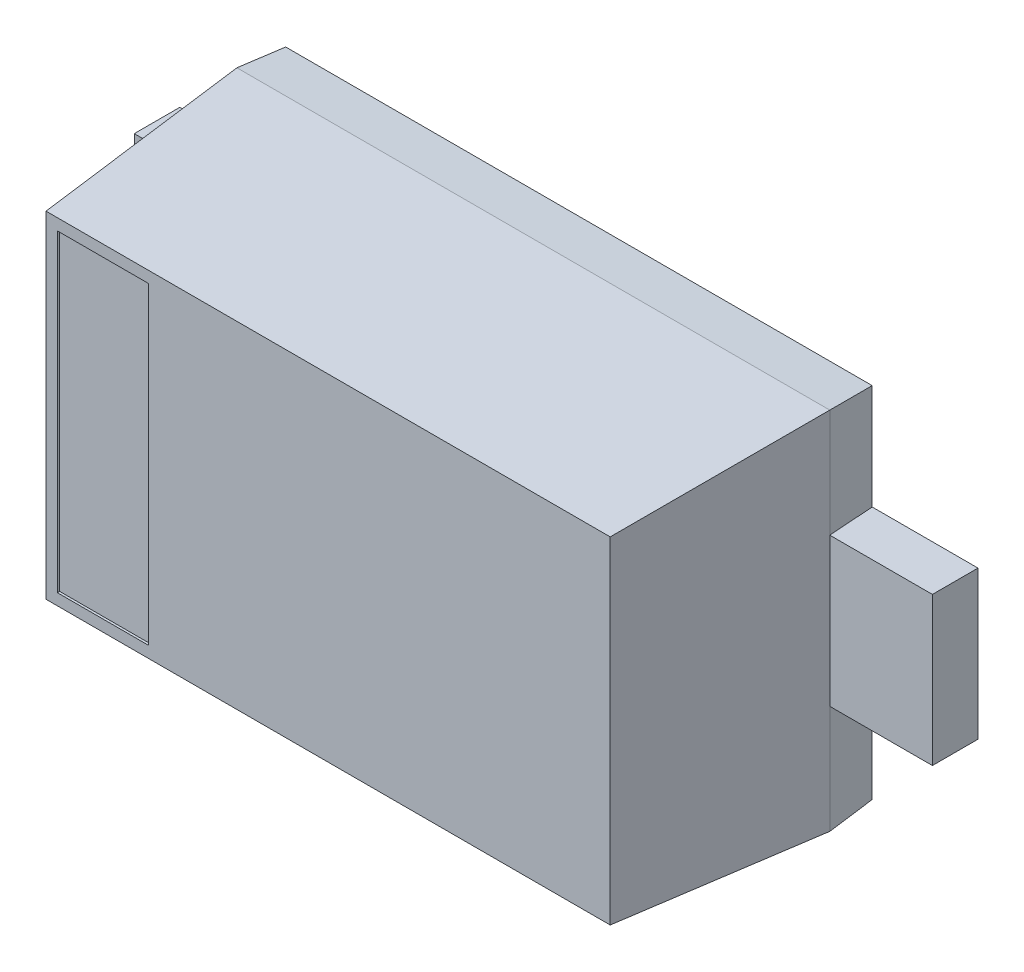
ISO-10303-21;
HEADER;
FILE_DESCRIPTION(('STEP AP214'),'2;1');
FILE_NAME('part.step','',(''),(''),'','','');
FILE_SCHEMA(('AUTOMOTIVE_DESIGN { 1 0 10303 214 1 1 1 1 }'));
ENDSEC;
DATA;
#1=APPLICATION_CONTEXT('core data for automotive mechanical design processes');
#2=APPLICATION_PROTOCOL_DEFINITION('international standard','automotive_design',2000,#1);
#3=PRODUCT_CONTEXT('',#1,'mechanical');
#4=PRODUCT('Part','Part','',(#3));
#5=PRODUCT_RELATED_PRODUCT_CATEGORY('part','',(#4));
#6=PRODUCT_DEFINITION_FORMATION('','',#4);
#7=PRODUCT_DEFINITION_CONTEXT('part definition',#1,'design');
#8=PRODUCT_DEFINITION('design','',#6,#7);
#9=PRODUCT_DEFINITION_SHAPE('','',#8);
#10=(LENGTH_UNIT() NAMED_UNIT(*) SI_UNIT(.MILLI.,.METRE.));
#11=(NAMED_UNIT(*) PLANE_ANGLE_UNIT() SI_UNIT($,.RADIAN.));
#12=(NAMED_UNIT(*) SI_UNIT($,.STERADIAN.) SOLID_ANGLE_UNIT());
#13=UNCERTAINTY_MEASURE_WITH_UNIT(LENGTH_MEASURE(1.E-05),#10,'distance_accuracy_value','');
#14=(GEOMETRIC_REPRESENTATION_CONTEXT(3) GLOBAL_UNCERTAINTY_ASSIGNED_CONTEXT((#13)) GLOBAL_UNIT_ASSIGNED_CONTEXT((#10,
#11,#12)) REPRESENTATION_CONTEXT('',''));
#15=CARTESIAN_POINT('',(0.,0.,0.));
#16=DIRECTION('',(0.,0.,1.));
#17=DIRECTION('',(1.,0.,0.));
#18=AXIS2_PLACEMENT_3D('',#15,#16,#17);
#19=CARTESIAN_POINT('',(-1.187065869251,-0.687065869251,1.09));
#20=DIRECTION('',(0.,0.,1.));
#21=DIRECTION('',(1.,0.,0.));
#22=AXIS2_PLACEMENT_3D('',#19,#20,#21);
#23=PLANE('',#22);
#24=DIRECTION('',(0.,1.,0.));
#25=VECTOR('',#24,1.);
#26=CARTESIAN_POINT('',(-0.787065869251,-0.687065869251,1.09));
#27=LINE('',#26,#25);
#28=CARTESIAN_POINT('',(-0.787065869251,-0.687065869251,1.09));
#29=VERTEX_POINT('',#28);
#30=CARTESIAN_POINT('',(-0.787065869251,0.687065869251,1.09));
#31=VERTEX_POINT('',#30);
#32=EDGE_CURVE('E241',#29,#31,#27,.T.);
#33=ORIENTED_EDGE('',*,*,#32,.T.);
#34=DIRECTION('',(1.,0.,0.));
#35=VECTOR('',#34,1.);
#36=CARTESIAN_POINT('',(-1.187065869251,0.687065869251,1.09));
#37=LINE('',#36,#35);
#38=CARTESIAN_POINT('',(-1.187065869251,0.687065869251,1.09));
#39=VERTEX_POINT('',#38);
#40=EDGE_CURVE('E238',#31,#39,#37,.F.);
#41=ORIENTED_EDGE('',*,*,#40,.T.);
#42=DIRECTION('',(0.,1.,0.));
#43=VECTOR('',#42,1.);
#44=CARTESIAN_POINT('',(-1.187065869251,-0.687065869251,1.09));
#45=LINE('',#44,#43);
#46=CARTESIAN_POINT('',(-1.187065869251,-0.687065869251,1.09));
#47=VERTEX_POINT('',#46);
#48=EDGE_CURVE('E158',#47,#39,#45,.T.);
#49=ORIENTED_EDGE('',*,*,#48,.F.);
#50=DIRECTION('',(1.,0.,0.));
#51=VECTOR('',#50,1.);
#52=CARTESIAN_POINT('',(-1.187065869251,-0.687065869251,1.09));
#53=LINE('',#52,#51);
#54=EDGE_CURVE('E243',#47,#29,#53,.T.);
#55=ORIENTED_EDGE('',*,*,#54,.T.);
#56=EDGE_LOOP('',(#33,#41,#49,#55));
#57=FACE_BOUND('',#56,.T.);
#58=ADVANCED_FACE('F17',(#57),#23,.T.);
#59=CARTESIAN_POINT('',(-0.787065869251,-0.687065869251,1.09));
#60=DIRECTION('',(1.,0.,0.));
#61=DIRECTION('',(0.,0.,-1.));
#62=AXIS2_PLACEMENT_3D('',#59,#60,#61);
#63=PLANE('',#62);
#64=DIRECTION('',(0.,0.,1.));
#65=VECTOR('',#64,1.);
#66=CARTESIAN_POINT('',(-0.787065869251,0.687065869251,1.09));
#67=LINE('',#66,#65);
#68=CARTESIAN_POINT('',(-0.787065869251,0.687065869251,1.1));
#69=VERTEX_POINT('',#68);
#70=EDGE_CURVE('E151',#69,#31,#67,.F.);
#71=ORIENTED_EDGE('',*,*,#70,.T.);
#72=ORIENTED_EDGE('',*,*,#32,.F.);
#73=DIRECTION('',(0.,0.,1.));
#74=VECTOR('',#73,1.);
#75=CARTESIAN_POINT('',(-0.787065869251,-0.687065869251,1.09));
#76=LINE('',#75,#74);
#77=CARTESIAN_POINT('',(-0.787065869251,-0.687065869251,1.1));
#78=VERTEX_POINT('',#77);
#79=EDGE_CURVE('E77',#78,#29,#76,.F.);
#80=ORIENTED_EDGE('',*,*,#79,.F.);
#81=DIRECTION('',(0.,1.,0.));
#82=VECTOR('',#81,1.);
#83=CARTESIAN_POINT('',(-0.787065869251,-0.737065869251,1.1));
#84=LINE('',#83,#82);
#85=EDGE_CURVE('E154',#78,#69,#84,.T.);
#86=ORIENTED_EDGE('',*,*,#85,.T.);
#87=EDGE_LOOP('',(#71,#72,#80,#86));
#88=FACE_BOUND('',#87,.T.);
#89=ADVANCED_FACE('F611',(#88),#63,.F.);
#90=CARTESIAN_POINT('',(-1.187065869251,0.687065869251,1.09));
#91=DIRECTION('',(0.,1.,0.));
#92=DIRECTION('',(0.,0.,1.));
#93=AXIS2_PLACEMENT_3D('',#90,#91,#92);
#94=PLANE('',#93);
#95=DIRECTION('',(0.,0.,-1.));
#96=VECTOR('',#95,1.);
#97=CARTESIAN_POINT('',(-1.187065869251,0.687065869251,1.09));
#98=LINE('',#97,#96);
#99=CARTESIAN_POINT('',(-1.187065869251,0.687065869251,1.1));
#100=VERTEX_POINT('',#99);
#101=EDGE_CURVE('E148',#39,#100,#98,.F.);
#102=ORIENTED_EDGE('',*,*,#101,.F.);
#103=ORIENTED_EDGE('',*,*,#40,.F.);
#104=ORIENTED_EDGE('',*,*,#70,.F.);
#105=DIRECTION('',(-1.,0.,0.));
#106=VECTOR('',#105,1.);
#107=CARTESIAN_POINT('',(-1.237065869251,0.687065869251,1.1));
#108=LINE('',#107,#106);
#109=EDGE_CURVE('E145',#69,#100,#108,.T.);
#110=ORIENTED_EDGE('',*,*,#109,.T.);
#111=EDGE_LOOP('',(#102,#103,#104,#110));
#112=FACE_BOUND('',#111,.T.);
#113=ADVANCED_FACE('F146',(#112),#94,.F.);
#114=CARTESIAN_POINT('',(-1.187065869251,-0.687065869251,1.09));
#115=DIRECTION('',(1.,0.,0.));
#116=DIRECTION('',(0.,0.,-1.));
#117=AXIS2_PLACEMENT_3D('',#114,#115,#116);
#118=PLANE('',#117);
#119=ORIENTED_EDGE('',*,*,#101,.T.);
#120=DIRECTION('',(0.,1.,0.));
#121=VECTOR('',#120,1.);
#122=CARTESIAN_POINT('',(-1.187065869251,-0.737065869251,1.1));
#123=LINE('',#122,#121);
#124=CARTESIAN_POINT('',(-1.187065869251,-0.687065869251,1.1));
#125=VERTEX_POINT('',#124);
#126=EDGE_CURVE('E137',#100,#125,#123,.F.);
#127=ORIENTED_EDGE('',*,*,#126,.T.);
#128=DIRECTION('',(0.,0.,1.));
#129=VECTOR('',#128,1.);
#130=CARTESIAN_POINT('',(-1.187065869251,-0.687065869251,1.09));
#131=LINE('',#130,#129);
#132=EDGE_CURVE('E233',#47,#125,#131,.T.);
#133=ORIENTED_EDGE('',*,*,#132,.F.);
#134=ORIENTED_EDGE('',*,*,#48,.T.);
#135=EDGE_LOOP('',(#119,#127,#133,#134));
#136=FACE_BOUND('',#135,.T.);
#137=ADVANCED_FACE('F156',(#136),#118,.T.);
#138=CARTESIAN_POINT('',(-1.187065869251,-0.687065869251,1.09));
#139=DIRECTION('',(0.,1.,0.));
#140=DIRECTION('',(0.,0.,1.));
#141=AXIS2_PLACEMENT_3D('',#138,#139,#140);
#142=PLANE('',#141);
#143=ORIENTED_EDGE('',*,*,#132,.T.);
#144=DIRECTION('',(-1.,0.,0.));
#145=VECTOR('',#144,1.);
#146=CARTESIAN_POINT('',(-1.237065869251,-0.687065869251,1.1));
#147=LINE('',#146,#145);
#148=EDGE_CURVE('E163',#125,#78,#147,.F.);
#149=ORIENTED_EDGE('',*,*,#148,.T.);
#150=ORIENTED_EDGE('',*,*,#79,.T.);
#151=ORIENTED_EDGE('',*,*,#54,.F.);
#152=EDGE_LOOP('',(#143,#149,#150,#151));
#153=FACE_BOUND('',#152,.T.);
#154=ADVANCED_FACE('F411',(#153),#142,.T.);
#155=CARTESIAN_POINT('',(-1.286014637611,0.325,0.2));
#156=DIRECTION('',(0.,0.,1.));
#157=DIRECTION('',(1.,0.,0.));
#158=AXIS2_PLACEMENT_3D('',#155,#156,#157);
#159=PLANE('',#158);
#160=DIRECTION('',(0.,-1.,0.));
#161=VECTOR('',#160,1.);
#162=CARTESIAN_POINT('',(-1.75,0.325,0.2));
#163=LINE('',#162,#161);
#164=CARTESIAN_POINT('',(-1.75,-0.325,0.2));
#165=VERTEX_POINT('',#164);
#166=CARTESIAN_POINT('',(-1.75,0.325,0.2));
#167=VERTEX_POINT('',#166);
#168=EDGE_CURVE('E173',#165,#167,#163,.F.);
#169=ORIENTED_EDGE('',*,*,#168,.F.);
#170=DIRECTION('',(1.,0.,0.));
#171=VECTOR('',#170,1.);
#172=CARTESIAN_POINT('',(-1.286014637611,-0.325,0.2));
#173=LINE('',#172,#171);
#174=CARTESIAN_POINT('',(-1.3,-0.325,0.2));
#175=VERTEX_POINT('',#174);
#176=EDGE_CURVE('E176',#175,#165,#173,.F.);
#177=ORIENTED_EDGE('',*,*,#176,.F.);
#178=DIRECTION('',(0.,-1.,0.));
#179=VECTOR('',#178,1.);
#180=CARTESIAN_POINT('',(-1.3,0.,0.2));
#181=LINE('',#180,#179);
#182=CARTESIAN_POINT('',(-1.3,0.325,0.2));
#183=VERTEX_POINT('',#182);
#184=EDGE_CURVE('E244',#183,#175,#181,.T.);
#185=ORIENTED_EDGE('',*,*,#184,.F.);
#186=DIRECTION('',(1.,0.,0.));
#187=VECTOR('',#186,1.);
#188=CARTESIAN_POINT('',(-1.286014637611,0.325,0.2));
#189=LINE('',#188,#187);
#190=EDGE_CURVE('E183',#183,#167,#189,.F.);
#191=ORIENTED_EDGE('',*,*,#190,.T.);
#192=EDGE_LOOP('',(#169,#177,#185,#191));
#193=FACE_BOUND('',#192,.T.);
#194=ADVANCED_FACE('F409',(#193),#159,.T.);
#195=CARTESIAN_POINT('',(-1.3,0.8,0.2));
#196=DIRECTION('',(-0.997564050259837,0.,0.0697564737439496));
#197=DIRECTION('',(0.,-1.,0.));
#198=AXIS2_PLACEMENT_3D('',#195,#196,#197);
#199=PLANE('',#198);
#200=DIRECTION('',(0.,1.,0.));
#201=VECTOR('',#200,1.);
#202=CARTESIAN_POINT('',(-1.237065869251,-0.737065869251,1.1));
#203=LINE('',#202,#201);
#204=CARTESIAN_POINT('',(-1.237065869251,-0.737065869251,1.1));
#205=VERTEX_POINT('',#204);
#206=CARTESIAN_POINT('',(-1.237065869251,0.737065869251,1.1));
#207=VERTEX_POINT('',#206);
#208=EDGE_CURVE('E170',#205,#207,#203,.T.);
#209=ORIENTED_EDGE('',*,*,#208,.T.);
#210=DIRECTION('',(0.0695873743164903,-0.0695873743164901,0.995145815783533));
#211=VECTOR('',#210,1.);
#212=CARTESIAN_POINT('',(-1.2685329346255,0.7685329346255,0.65));
#213=LINE('',#212,#211);
#214=CARTESIAN_POINT('',(-1.3,0.8,0.2));
#215=VERTEX_POINT('',#214);
#216=EDGE_CURVE('E261',#215,#207,#213,.T.);
#217=ORIENTED_EDGE('',*,*,#216,.F.);
#218=DIRECTION('',(0.,-1.,0.));
#219=VECTOR('',#218,1.);
#220=CARTESIAN_POINT('',(-1.3,0.,0.2));
#221=LINE('',#220,#219);
#222=EDGE_CURVE('E235',#215,#183,#221,.T.);
#223=ORIENTED_EDGE('',*,*,#222,.T.);
#224=ORIENTED_EDGE('',*,*,#184,.T.);
#225=DIRECTION('',(0.,-1.,0.));
#226=VECTOR('',#225,1.);
#227=CARTESIAN_POINT('',(-1.3,0.,0.2));
#228=LINE('',#227,#226);
#229=CARTESIAN_POINT('',(-1.3,-0.8,0.2));
#230=VERTEX_POINT('',#229);
#231=EDGE_CURVE('E68',#175,#230,#228,.T.);
#232=ORIENTED_EDGE('',*,*,#231,.T.);
#233=DIRECTION('',(-0.0695873743164903,-0.0695873743164901,-0.995145815783533));
#234=VECTOR('',#233,1.);
#235=CARTESIAN_POINT('',(-1.2685329346255,-0.7685329346255,0.65));
#236=LINE('',#235,#234);
#237=EDGE_CURVE('E177',#205,#230,#236,.T.);
#238=ORIENTED_EDGE('',*,*,#237,.F.);
#239=EDGE_LOOP('',(#209,#217,#223,#224,#232,#238));
#240=FACE_BOUND('',#239,.T.);
#241=ADVANCED_FACE('F392',(#240),#199,.T.);
#242=CARTESIAN_POINT('',(-1.237065869251,-0.737065869251,1.1));
#243=DIRECTION('',(0.,0.,-1.));
#244=DIRECTION('',(-1.,0.,0.));
#245=AXIS2_PLACEMENT_3D('',#242,#243,#244);
#246=PLANE('',#245);
#247=ORIENTED_EDGE('',*,*,#126,.F.);
#248=ORIENTED_EDGE('',*,*,#109,.F.);
#249=ORIENTED_EDGE('',*,*,#85,.F.);
#250=ORIENTED_EDGE('',*,*,#148,.F.);
#251=EDGE_LOOP('',(#247,#248,#249,#250));
#252=FACE_BOUND('',#251,.T.);
#253=DIRECTION('',(1.,0.,0.));
#254=VECTOR('',#253,1.);
#255=CARTESIAN_POINT('',(0.,0.737065869251,1.1));
#256=LINE('',#255,#254);
#257=CARTESIAN_POINT('',(1.237065869251,0.737065869251,1.1));
#258=VERTEX_POINT('',#257);
#259=EDGE_CURVE('E198',#207,#258,#256,.T.);
#260=ORIENTED_EDGE('',*,*,#259,.F.);
#261=ORIENTED_EDGE('',*,*,#208,.F.);
#262=DIRECTION('',(-1.,0.,0.));
#263=VECTOR('',#262,1.);
#264=CARTESIAN_POINT('',(0.,-0.737065869251,1.1));
#265=LINE('',#264,#263);
#266=CARTESIAN_POINT('',(1.237065869251,-0.737065869251,1.1));
#267=VERTEX_POINT('',#266);
#268=EDGE_CURVE('E217',#267,#205,#265,.T.);
#269=ORIENTED_EDGE('',*,*,#268,.F.);
#270=DIRECTION('',(0.,-1.,0.));
#271=VECTOR('',#270,1.);
#272=CARTESIAN_POINT('',(1.237065869251,0.,1.1));
#273=LINE('',#272,#271);
#274=EDGE_CURVE('E188',#258,#267,#273,.T.);
#275=ORIENTED_EDGE('',*,*,#274,.F.);
#276=EDGE_LOOP('',(#260,#261,#269,#275));
#277=FACE_BOUND('',#276,.T.);
#278=ADVANCED_FACE('F161',(#252,#277),#246,.F.);
#279=CARTESIAN_POINT('',(1.3,-0.8,0.2));
#280=DIRECTION('',(0.997564050259837,0.,0.0697564737439496));
#281=DIRECTION('',(0.,1.,0.));
#282=AXIS2_PLACEMENT_3D('',#279,#280,#281);
#283=PLANE('',#282);
#284=ORIENTED_EDGE('',*,*,#274,.T.);
#285=DIRECTION('',(-0.0695873743164903,0.0695873743164901,0.995145815783533));
#286=VECTOR('',#285,1.);
#287=CARTESIAN_POINT('',(1.2685329346255,-0.7685329346255,0.65));
#288=LINE('',#287,#286);
#289=CARTESIAN_POINT('',(1.3,-0.8,0.2));
#290=VERTEX_POINT('',#289);
#291=EDGE_CURVE('E214',#290,#267,#288,.T.);
#292=ORIENTED_EDGE('',*,*,#291,.F.);
#293=DIRECTION('',(0.,1.,0.));
#294=VECTOR('',#293,1.);
#295=CARTESIAN_POINT('',(1.3,0.,0.2));
#296=LINE('',#295,#294);
#297=CARTESIAN_POINT('',(1.3,-0.325,0.2));
#298=VERTEX_POINT('',#297);
#299=EDGE_CURVE('E165',#290,#298,#296,.T.);
#300=ORIENTED_EDGE('',*,*,#299,.T.);
#301=DIRECTION('',(0.,1.,0.));
#302=VECTOR('',#301,1.);
#303=CARTESIAN_POINT('',(1.3,-0.325,0.2));
#304=LINE('',#303,#302);
#305=CARTESIAN_POINT('',(1.3,0.325,0.2));
#306=VERTEX_POINT('',#305);
#307=EDGE_CURVE('E218',#306,#298,#304,.F.);
#308=ORIENTED_EDGE('',*,*,#307,.F.);
#309=DIRECTION('',(0.,1.,0.));
#310=VECTOR('',#309,1.);
#311=CARTESIAN_POINT('',(1.3,0.,0.2));
#312=LINE('',#311,#310);
#313=CARTESIAN_POINT('',(1.3,0.8,0.2));
#314=VERTEX_POINT('',#313);
#315=EDGE_CURVE('E186',#306,#314,#312,.T.);
#316=ORIENTED_EDGE('',*,*,#315,.T.);
#317=DIRECTION('',(0.0695873743164903,0.0695873743164901,-0.995145815783533));
#318=VECTOR('',#317,1.);
#319=CARTESIAN_POINT('',(1.2685329346255,0.7685329346255,0.65));
#320=LINE('',#319,#318);
#321=EDGE_CURVE('E194',#258,#314,#320,.T.);
#322=ORIENTED_EDGE('',*,*,#321,.F.);
#323=EDGE_LOOP('',(#284,#292,#300,#308,#316,#322));
#324=FACE_BOUND('',#323,.T.);
#325=ADVANCED_FACE('F316',(#324),#283,.T.);
#326=CARTESIAN_POINT('',(1.286014637611,-0.325,0.2));
#327=DIRECTION('',(0.,0.,1.));
#328=DIRECTION('',(1.,0.,0.));
#329=AXIS2_PLACEMENT_3D('',#326,#327,#328);
#330=PLANE('',#329);
#331=DIRECTION('',(0.,1.,0.));
#332=VECTOR('',#331,1.);
#333=CARTESIAN_POINT('',(1.75,-0.325,0.2));
#334=LINE('',#333,#332);
#335=CARTESIAN_POINT('',(1.75,0.325,0.2));
#336=VERTEX_POINT('',#335);
#337=CARTESIAN_POINT('',(1.75,-0.325,0.2));
#338=VERTEX_POINT('',#337);
#339=EDGE_CURVE('E197',#336,#338,#334,.F.);
#340=ORIENTED_EDGE('',*,*,#339,.F.);
#341=DIRECTION('',(-1.,0.,0.));
#342=VECTOR('',#341,1.);
#343=CARTESIAN_POINT('',(1.286014637611,0.325,0.2));
#344=LINE('',#343,#342);
#345=EDGE_CURVE('E303',#306,#336,#344,.F.);
#346=ORIENTED_EDGE('',*,*,#345,.F.);
#347=ORIENTED_EDGE('',*,*,#307,.T.);
#348=DIRECTION('',(-1.,0.,0.));
#349=VECTOR('',#348,1.);
#350=CARTESIAN_POINT('',(1.286014637611,-0.325,0.2));
#351=LINE('',#350,#349);
#352=EDGE_CURVE('E124',#298,#338,#351,.F.);
#353=ORIENTED_EDGE('',*,*,#352,.T.);
#354=EDGE_LOOP('',(#340,#346,#347,#353));
#355=FACE_BOUND('',#354,.T.);
#356=ADVANCED_FACE('F446',(#355),#330,.T.);
#357=CARTESIAN_POINT('',(-1.3,-0.8,0.2));
#358=DIRECTION('',(0.,-0.997564050259837,0.0697564737439495));
#359=DIRECTION('',(1.,0.,0.));
#360=AXIS2_PLACEMENT_3D('',#357,#358,#359);
#361=PLANE('',#360);
#362=ORIENTED_EDGE('',*,*,#268,.T.);
#363=ORIENTED_EDGE('',*,*,#237,.T.);
#364=DIRECTION('',(-1.,0.,0.));
#365=VECTOR('',#364,1.);
#366=CARTESIAN_POINT('',(0.,-0.8,0.2));
#367=LINE('',#366,#365);
#368=EDGE_CURVE('E221',#290,#230,#367,.T.);
#369=ORIENTED_EDGE('',*,*,#368,.F.);
#370=ORIENTED_EDGE('',*,*,#291,.T.);
#371=EDGE_LOOP('',(#362,#363,#369,#370));
#372=FACE_BOUND('',#371,.T.);
#373=ADVANCED_FACE('F322',(#372),#361,.T.);
#374=CARTESIAN_POINT('',(-1.75,0.325,0.));
#375=DIRECTION('',(-1.,0.,0.));
#376=DIRECTION('',(0.,-1.,0.));
#377=AXIS2_PLACEMENT_3D('',#374,#375,#376);
#378=PLANE('',#377);
#379=DIRECTION('',(0.,0.,1.));
#380=VECTOR('',#379,1.);
#381=CARTESIAN_POINT('',(-1.75,-0.325,0.));
#382=LINE('',#381,#380);
#383=CARTESIAN_POINT('',(-1.75,-0.325,0.));
#384=VERTEX_POINT('',#383);
#385=EDGE_CURVE('E180',#165,#384,#382,.F.);
#386=ORIENTED_EDGE('',*,*,#385,.F.);
#387=ORIENTED_EDGE('',*,*,#168,.T.);
#388=DIRECTION('',(0.,0.,1.));
#389=VECTOR('',#388,1.);
#390=CARTESIAN_POINT('',(-1.75,0.325,0.));
#391=LINE('',#390,#389);
#392=CARTESIAN_POINT('',(-1.75,0.325,0.));
#393=VERTEX_POINT('',#392);
#394=EDGE_CURVE('E264',#167,#393,#391,.F.);
#395=ORIENTED_EDGE('',*,*,#394,.T.);
#396=DIRECTION('',(0.,1.,0.));
#397=VECTOR('',#396,1.);
#398=CARTESIAN_POINT('',(-1.75,0.325,0.));
#399=LINE('',#398,#397);
#400=EDGE_CURVE('E283',#393,#384,#399,.F.);
#401=ORIENTED_EDGE('',*,*,#400,.T.);
#402=EDGE_LOOP('',(#386,#387,#395,#401));
#403=FACE_BOUND('',#402,.T.);
#404=ADVANCED_FACE('F379',(#403),#378,.T.);
#405=CARTESIAN_POINT('',(-1.286014637611,-0.325,0.));
#406=DIRECTION('',(0.,-1.,0.));
#407=DIRECTION('',(1.,0.,0.));
#408=AXIS2_PLACEMENT_3D('',#405,#406,#407);
#409=PLANE('',#408);
#410=ORIENTED_EDGE('',*,*,#176,.T.);
#411=ORIENTED_EDGE('',*,*,#385,.T.);
#412=DIRECTION('',(1.,0.,0.));
#413=VECTOR('',#412,1.);
#414=CARTESIAN_POINT('',(-1.286014637611,-0.325,0.));
#415=LINE('',#414,#413);
#416=CARTESIAN_POINT('',(-1.286014637611,-0.325,0.));
#417=VERTEX_POINT('',#416);
#418=EDGE_CURVE('E277',#384,#417,#415,.T.);
#419=ORIENTED_EDGE('',*,*,#418,.T.);
#420=DIRECTION('',(-0.0697564737456045,0.,0.997564050259721));
#421=VECTOR('',#420,1.);
#422=CARTESIAN_POINT('',(-1.286014637611,-0.325,0.));
#423=LINE('',#422,#421);
#424=EDGE_CURVE('E21',#175,#417,#423,.F.);
#425=ORIENTED_EDGE('',*,*,#424,.F.);
#426=EDGE_LOOP('',(#410,#411,#419,#425));
#427=FACE_BOUND('',#426,.T.);
#428=ADVANCED_FACE('F407',(#427),#409,.T.);
#429=CARTESIAN_POINT('',(-1.286014637611,0.325,0.));
#430=DIRECTION('',(0.,-1.,0.));
#431=DIRECTION('',(1.,0.,0.));
#432=AXIS2_PLACEMENT_3D('',#429,#430,#431);
#433=PLANE('',#432);
#434=ORIENTED_EDGE('',*,*,#190,.F.);
#435=DIRECTION('',(-0.0697564737456045,0.,0.997564050259721));
#436=VECTOR('',#435,1.);
#437=CARTESIAN_POINT('',(-1.286014637611,0.325,0.));
#438=LINE('',#437,#436);
#439=CARTESIAN_POINT('',(-1.286014637611,0.325,0.));
#440=VERTEX_POINT('',#439);
#441=EDGE_CURVE('E269',#440,#183,#438,.T.);
#442=ORIENTED_EDGE('',*,*,#441,.F.);
#443=DIRECTION('',(1.,0.,0.));
#444=VECTOR('',#443,1.);
#445=CARTESIAN_POINT('',(-1.286014637611,0.325,0.));
#446=LINE('',#445,#444);
#447=EDGE_CURVE('E254',#440,#393,#446,.F.);
#448=ORIENTED_EDGE('',*,*,#447,.T.);
#449=ORIENTED_EDGE('',*,*,#394,.F.);
#450=EDGE_LOOP('',(#434,#442,#448,#449));
#451=FACE_BOUND('',#450,.T.);
#452=ADVANCED_FACE('F383',(#451),#433,.F.);
#453=CARTESIAN_POINT('',(1.3,0.8,0.2));
#454=DIRECTION('',(0.,0.997564050259837,0.0697564737439495));
#455=DIRECTION('',(-1.,0.,0.));
#456=AXIS2_PLACEMENT_3D('',#453,#454,#455);
#457=PLANE('',#456);
#458=ORIENTED_EDGE('',*,*,#259,.T.);
#459=ORIENTED_EDGE('',*,*,#321,.T.);
#460=DIRECTION('',(1.,0.,0.));
#461=VECTOR('',#460,1.);
#462=CARTESIAN_POINT('',(0.,0.8,0.2));
#463=LINE('',#462,#461);
#464=EDGE_CURVE('E201',#215,#314,#463,.T.);
#465=ORIENTED_EDGE('',*,*,#464,.F.);
#466=ORIENTED_EDGE('',*,*,#216,.T.);
#467=EDGE_LOOP('',(#458,#459,#465,#466));
#468=FACE_BOUND('',#467,.T.);
#469=ADVANCED_FACE('F395',(#468),#457,.T.);
#470=CARTESIAN_POINT('',(1.75,-0.325,0.));
#471=DIRECTION('',(1.,0.,0.));
#472=DIRECTION('',(0.,1.,0.));
#473=AXIS2_PLACEMENT_3D('',#470,#471,#472);
#474=PLANE('',#473);
#475=DIRECTION('',(0.,0.,1.));
#476=VECTOR('',#475,1.);
#477=CARTESIAN_POINT('',(1.75,0.325,0.));
#478=LINE('',#477,#476);
#479=CARTESIAN_POINT('',(1.75,0.325,0.));
#480=VERTEX_POINT('',#479);
#481=EDGE_CURVE('E307',#336,#480,#478,.F.);
#482=ORIENTED_EDGE('',*,*,#481,.F.);
#483=ORIENTED_EDGE('',*,*,#339,.T.);
#484=DIRECTION('',(0.,0.,1.));
#485=VECTOR('',#484,1.);
#486=CARTESIAN_POINT('',(1.75,-0.325,0.));
#487=LINE('',#486,#485);
#488=CARTESIAN_POINT('',(1.75,-0.325,0.));
#489=VERTEX_POINT('',#488);
#490=EDGE_CURVE('E224',#338,#489,#487,.F.);
#491=ORIENTED_EDGE('',*,*,#490,.T.);
#492=DIRECTION('',(0.,1.,0.));
#493=VECTOR('',#492,1.);
#494=CARTESIAN_POINT('',(1.75,-0.325,0.));
#495=LINE('',#494,#493);
#496=EDGE_CURVE('E339',#489,#480,#495,.T.);
#497=ORIENTED_EDGE('',*,*,#496,.T.);
#498=EDGE_LOOP('',(#482,#483,#491,#497));
#499=FACE_BOUND('',#498,.T.);
#500=ADVANCED_FACE('F435',(#499),#474,.T.);
#501=CARTESIAN_POINT('',(1.286014637611,0.325,0.));
#502=DIRECTION('',(0.,1.,0.));
#503=DIRECTION('',(-1.,0.,0.));
#504=AXIS2_PLACEMENT_3D('',#501,#502,#503);
#505=PLANE('',#504);
#506=ORIENTED_EDGE('',*,*,#345,.T.);
#507=ORIENTED_EDGE('',*,*,#481,.T.);
#508=DIRECTION('',(1.,0.,0.));
#509=VECTOR('',#508,1.);
#510=CARTESIAN_POINT('',(1.286014637611,0.325,0.));
#511=LINE('',#510,#509);
#512=CARTESIAN_POINT('',(1.286014637611,0.325,0.));
#513=VERTEX_POINT('',#512);
#514=EDGE_CURVE('E230',#480,#513,#511,.F.);
#515=ORIENTED_EDGE('',*,*,#514,.T.);
#516=DIRECTION('',(0.0697564737456045,0.,0.997564050259721));
#517=VECTOR('',#516,1.);
#518=CARTESIAN_POINT('',(1.286014637611,0.325,0.));
#519=LINE('',#518,#517);
#520=EDGE_CURVE('E204',#306,#513,#519,.F.);
#521=ORIENTED_EDGE('',*,*,#520,.F.);
#522=EDGE_LOOP('',(#506,#507,#515,#521));
#523=FACE_BOUND('',#522,.T.);
#524=ADVANCED_FACE('F432',(#523),#505,.T.);
#525=CARTESIAN_POINT('',(1.286014637611,-0.325,0.));
#526=DIRECTION('',(0.,1.,0.));
#527=DIRECTION('',(-1.,0.,0.));
#528=AXIS2_PLACEMENT_3D('',#525,#526,#527);
#529=PLANE('',#528);
#530=ORIENTED_EDGE('',*,*,#352,.F.);
#531=DIRECTION('',(0.0697564737456045,0.,0.997564050259721));
#532=VECTOR('',#531,1.);
#533=CARTESIAN_POINT('',(1.286014637611,-0.325,0.));
#534=LINE('',#533,#532);
#535=CARTESIAN_POINT('',(1.286014637611,-0.325,0.));
#536=VERTEX_POINT('',#535);
#537=EDGE_CURVE('E36',#536,#298,#534,.T.);
#538=ORIENTED_EDGE('',*,*,#537,.F.);
#539=DIRECTION('',(1.,0.,0.));
#540=VECTOR('',#539,1.);
#541=CARTESIAN_POINT('',(1.286014637611,-0.325,0.));
#542=LINE('',#541,#540);
#543=EDGE_CURVE('E211',#536,#489,#542,.T.);
#544=ORIENTED_EDGE('',*,*,#543,.T.);
#545=ORIENTED_EDGE('',*,*,#490,.F.);
#546=EDGE_LOOP('',(#530,#538,#544,#545));
#547=FACE_BOUND('',#546,.T.);
#548=ADVANCED_FACE('F429',(#547),#529,.F.);
#549=CARTESIAN_POINT('',(-1.286014637611,-0.786014637611,0.));
#550=DIRECTION('',(0.,-0.997564050259721,-0.069756473745604));
#551=DIRECTION('',(1.,0.,0.));
#552=AXIS2_PLACEMENT_3D('',#549,#550,#551);
#553=PLANE('',#552);
#554=ORIENTED_EDGE('',*,*,#368,.T.);
#555=DIRECTION('',(-0.0695873743181331,-0.0695873743181326,0.995145815783303));
#556=VECTOR('',#555,1.);
#557=CARTESIAN_POINT('',(-1.2930073188055,-0.7930073188055,0.1));
#558=LINE('',#557,#556);
#559=CARTESIAN_POINT('',(-1.286014637611,-0.786014637611,0.));
#560=VERTEX_POINT('',#559);
#561=EDGE_CURVE('E252',#560,#230,#558,.T.);
#562=ORIENTED_EDGE('',*,*,#561,.F.);
#563=DIRECTION('',(-1.,0.,0.));
#564=VECTOR('',#563,1.);
#565=CARTESIAN_POINT('',(-1.286014637611,-0.786014637611,0.));
#566=LINE('',#565,#564);
#567=CARTESIAN_POINT('',(1.286014637611,-0.786014637611,0.));
#568=VERTEX_POINT('',#567);
#569=EDGE_CURVE('E274',#568,#560,#566,.T.);
#570=ORIENTED_EDGE('',*,*,#569,.F.);
#571=DIRECTION('',(-0.0695873743181331,0.0695873743181326,-0.995145815783303));
#572=VECTOR('',#571,1.);
#573=CARTESIAN_POINT('',(1.2930073188055,-0.7930073188055,0.1));
#574=LINE('',#573,#572);
#575=EDGE_CURVE('E227',#290,#568,#574,.T.);
#576=ORIENTED_EDGE('',*,*,#575,.F.);
#577=EDGE_LOOP('',(#554,#562,#570,#576));
#578=FACE_BOUND('',#577,.T.);
#579=ADVANCED_FACE('F327',(#578),#553,.T.);
#580=CARTESIAN_POINT('',(-1.286014637611,0.786014637611,0.));
#581=DIRECTION('',(-0.997564050259721,0.,-0.0697564737456045));
#582=DIRECTION('',(0.,-1.,0.));
#583=AXIS2_PLACEMENT_3D('',#580,#581,#582);
#584=PLANE('',#583);
#585=ORIENTED_EDGE('',*,*,#561,.T.);
#586=ORIENTED_EDGE('',*,*,#231,.F.);
#587=ORIENTED_EDGE('',*,*,#424,.T.);
#588=DIRECTION('',(0.,1.,0.));
#589=VECTOR('',#588,1.);
#590=CARTESIAN_POINT('',(-1.286014637611,-0.786014637611,0.));
#591=LINE('',#590,#589);
#592=EDGE_CURVE('E292',#560,#417,#591,.T.);
#593=ORIENTED_EDGE('',*,*,#592,.F.);
#594=EDGE_LOOP('',(#585,#586,#587,#593));
#595=FACE_BOUND('',#594,.T.);
#596=ADVANCED_FACE('F405',(#595),#584,.T.);
#597=CARTESIAN_POINT('',(-1.286014637611,0.786014637611,0.));
#598=DIRECTION('',(-0.997564050259721,0.,-0.0697564737456045));
#599=DIRECTION('',(0.,-1.,0.));
#600=AXIS2_PLACEMENT_3D('',#597,#598,#599);
#601=PLANE('',#600);
#602=ORIENTED_EDGE('',*,*,#441,.T.);
#603=ORIENTED_EDGE('',*,*,#222,.F.);
#604=DIRECTION('',(-0.0695873743181331,0.0695873743181326,0.995145815783303));
#605=VECTOR('',#604,1.);
#606=CARTESIAN_POINT('',(-1.2930073188055,0.7930073188055,0.1));
#607=LINE('',#606,#605);
#608=CARTESIAN_POINT('',(-1.286014637611,0.786014637611,0.));
#609=VERTEX_POINT('',#608);
#610=EDGE_CURVE('E205',#609,#215,#607,.T.);
#611=ORIENTED_EDGE('',*,*,#610,.F.);
#612=DIRECTION('',(0.,1.,0.));
#613=VECTOR('',#612,1.);
#614=CARTESIAN_POINT('',(-1.286014637611,-0.786014637611,0.));
#615=LINE('',#614,#613);
#616=EDGE_CURVE('E295',#440,#609,#615,.T.);
#617=ORIENTED_EDGE('',*,*,#616,.F.);
#618=EDGE_LOOP('',(#602,#603,#611,#617));
#619=FACE_BOUND('',#618,.T.);
#620=ADVANCED_FACE('F402',(#619),#601,.T.);
#621=CARTESIAN_POINT('',(1.286014637611,0.786014637611,0.));
#622=DIRECTION('',(0.,0.997564050259721,-0.069756473745604));
#623=DIRECTION('',(-1.,0.,0.));
#624=AXIS2_PLACEMENT_3D('',#621,#622,#623);
#625=PLANE('',#624);
#626=ORIENTED_EDGE('',*,*,#464,.T.);
#627=DIRECTION('',(0.0695873743181331,0.0695873743181326,0.995145815783303));
#628=VECTOR('',#627,1.);
#629=CARTESIAN_POINT('',(1.2930073188055,0.7930073188055,0.1));
#630=LINE('',#629,#628);
#631=CARTESIAN_POINT('',(1.286014637611,0.786014637611,0.));
#632=VERTEX_POINT('',#631);
#633=EDGE_CURVE('E208',#632,#314,#630,.T.);
#634=ORIENTED_EDGE('',*,*,#633,.F.);
#635=DIRECTION('',(-1.,0.,0.));
#636=VECTOR('',#635,1.);
#637=CARTESIAN_POINT('',(-1.286014637611,0.786014637611,0.));
#638=LINE('',#637,#636);
#639=EDGE_CURVE('E359',#609,#632,#638,.F.);
#640=ORIENTED_EDGE('',*,*,#639,.F.);
#641=ORIENTED_EDGE('',*,*,#610,.T.);
#642=EDGE_LOOP('',(#626,#634,#640,#641));
#643=FACE_BOUND('',#642,.T.);
#644=ADVANCED_FACE('F400',(#643),#625,.T.);
#645=CARTESIAN_POINT('',(1.286014637611,-0.786014637611,0.));
#646=DIRECTION('',(0.997564050259721,0.,-0.0697564737456045));
#647=DIRECTION('',(0.,1.,0.));
#648=AXIS2_PLACEMENT_3D('',#645,#646,#647);
#649=PLANE('',#648);
#650=ORIENTED_EDGE('',*,*,#633,.T.);
#651=ORIENTED_EDGE('',*,*,#315,.F.);
#652=ORIENTED_EDGE('',*,*,#520,.T.);
#653=DIRECTION('',(0.,1.,0.));
#654=VECTOR('',#653,1.);
#655=CARTESIAN_POINT('',(1.286014637611,-0.786014637611,0.));
#656=LINE('',#655,#654);
#657=EDGE_CURVE('E27',#632,#513,#656,.F.);
#658=ORIENTED_EDGE('',*,*,#657,.F.);
#659=EDGE_LOOP('',(#650,#651,#652,#658));
#660=FACE_BOUND('',#659,.T.);
#661=ADVANCED_FACE('F427',(#660),#649,.T.);
#662=CARTESIAN_POINT('',(1.286014637611,-0.786014637611,0.));
#663=DIRECTION('',(0.997564050259721,0.,-0.0697564737456045));
#664=DIRECTION('',(0.,1.,0.));
#665=AXIS2_PLACEMENT_3D('',#662,#663,#664);
#666=PLANE('',#665);
#667=ORIENTED_EDGE('',*,*,#537,.T.);
#668=ORIENTED_EDGE('',*,*,#299,.F.);
#669=ORIENTED_EDGE('',*,*,#575,.T.);
#670=DIRECTION('',(0.,1.,0.));
#671=VECTOR('',#670,1.);
#672=CARTESIAN_POINT('',(1.286014637611,-0.786014637611,0.));
#673=LINE('',#672,#671);
#674=EDGE_CURVE('E11',#536,#568,#673,.F.);
#675=ORIENTED_EDGE('',*,*,#674,.F.);
#676=EDGE_LOOP('',(#667,#668,#669,#675));
#677=FACE_BOUND('',#676,.T.);
#678=ADVANCED_FACE('F19',(#677),#666,.T.);
#679=CARTESIAN_POINT('',(-1.286014637611,-0.786014637611,0.));
#680=DIRECTION('',(0.,0.,-1.));
#681=DIRECTION('',(-1.,0.,0.));
#682=AXIS2_PLACEMENT_3D('',#679,#680,#681);
#683=PLANE('',#682);
#684=ORIENTED_EDGE('',*,*,#657,.T.);
#685=ORIENTED_EDGE('',*,*,#514,.F.);
#686=ORIENTED_EDGE('',*,*,#496,.F.);
#687=ORIENTED_EDGE('',*,*,#543,.F.);
#688=ORIENTED_EDGE('',*,*,#674,.T.);
#689=ORIENTED_EDGE('',*,*,#569,.T.);
#690=ORIENTED_EDGE('',*,*,#592,.T.);
#691=ORIENTED_EDGE('',*,*,#418,.F.);
#692=ORIENTED_EDGE('',*,*,#400,.F.);
#693=ORIENTED_EDGE('',*,*,#447,.F.);
#694=ORIENTED_EDGE('',*,*,#616,.T.);
#695=ORIENTED_EDGE('',*,*,#639,.T.);
#696=EDGE_LOOP('',(#684,#685,#686,#687,#688,#689,#690,#691,#692,#693,#694,#695));
#697=FACE_BOUND('',#696,.T.);
#698=ADVANCED_FACE('F335',(#697),#683,.T.);
#699=CLOSED_SHELL('',(#58,#89,#113,#137,#154,#194,#241,#278,#325,#356,#373,#404,#428,#452,#469,
#500,#524,#548,#579,#596,#620,#644,#661,#678,#698));
#700=MANIFOLD_SOLID_BREP('B1',#699);
#701=ADVANCED_BREP_SHAPE_REPRESENTATION('',(#18,#700),#14);
#702=SHAPE_DEFINITION_REPRESENTATION(#9,#701);
ENDSEC;
END-ISO-10303-21;
